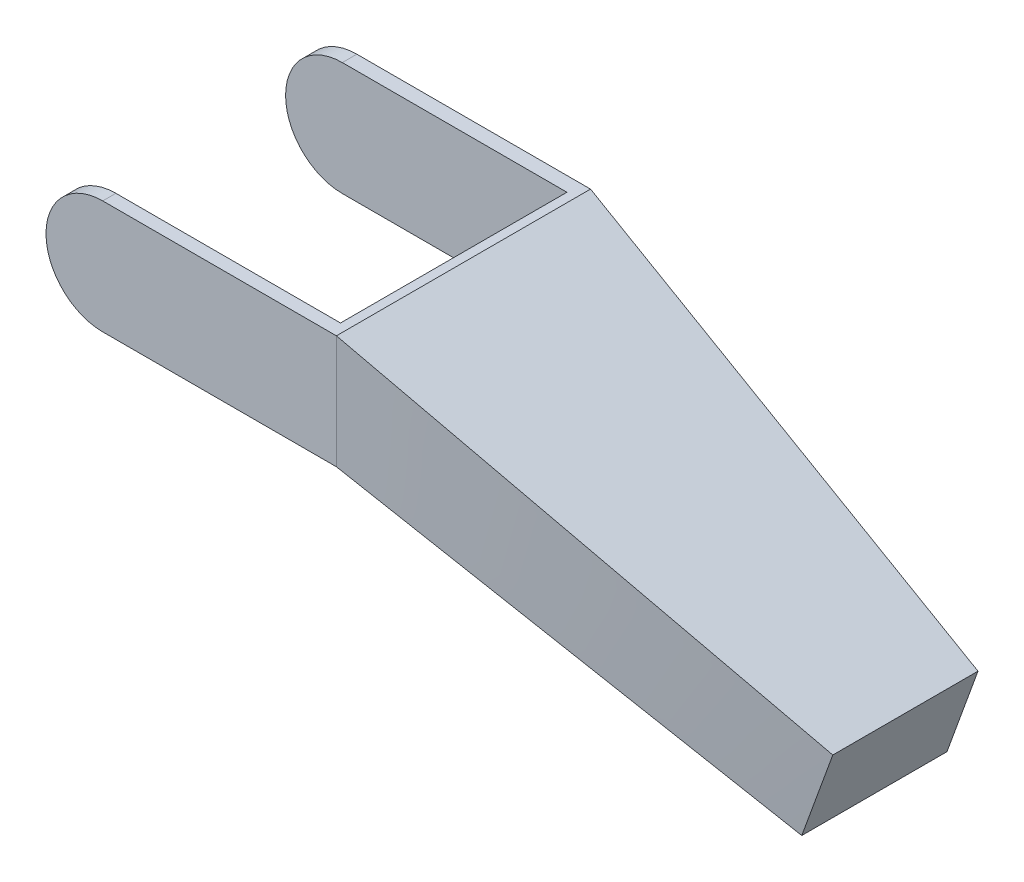
ISO-10303-21;
HEADER;
FILE_DESCRIPTION(('STEP AP214'),'2;1');
FILE_NAME('part.step','',(''),(''),'','','');
FILE_SCHEMA(('AUTOMOTIVE_DESIGN { 1 0 10303 214 1 1 1 1 }'));
ENDSEC;
DATA;
#1=APPLICATION_CONTEXT('core data for automotive mechanical design processes');
#2=APPLICATION_PROTOCOL_DEFINITION('international standard','automotive_design',2000,#1);
#3=PRODUCT_CONTEXT('',#1,'mechanical');
#4=PRODUCT('Part','Part','',(#3));
#5=PRODUCT_RELATED_PRODUCT_CATEGORY('part','',(#4));
#6=PRODUCT_DEFINITION_FORMATION('','',#4);
#7=PRODUCT_DEFINITION_CONTEXT('part definition',#1,'design');
#8=PRODUCT_DEFINITION('design','',#6,#7);
#9=PRODUCT_DEFINITION_SHAPE('','',#8);
#10=(LENGTH_UNIT() NAMED_UNIT(*) SI_UNIT(.MILLI.,.METRE.));
#11=(NAMED_UNIT(*) PLANE_ANGLE_UNIT() SI_UNIT($,.RADIAN.));
#12=(NAMED_UNIT(*) SI_UNIT($,.STERADIAN.) SOLID_ANGLE_UNIT());
#13=UNCERTAINTY_MEASURE_WITH_UNIT(LENGTH_MEASURE(1.E-05),#10,'distance_accuracy_value','');
#14=(GEOMETRIC_REPRESENTATION_CONTEXT(3) GLOBAL_UNCERTAINTY_ASSIGNED_CONTEXT((#13)) GLOBAL_UNIT_ASSIGNED_CONTEXT((#10,
#11,#12)) REPRESENTATION_CONTEXT('',''));
#15=CARTESIAN_POINT('',(0.,0.,0.));
#16=DIRECTION('',(0.,0.,1.));
#17=DIRECTION('',(1.,0.,0.));
#18=AXIS2_PLACEMENT_3D('',#15,#16,#17);
#19=CARTESIAN_POINT('',(0.,0.,28.));
#20=DIRECTION('',(0.,0.,-1.));
#21=DIRECTION('',(-1.,0.,0.));
#22=AXIS2_PLACEMENT_3D('',#19,#20,#21);
#23=CYLINDRICAL_SURFACE('',#22,12.5);
#24=CARTESIAN_POINT('',(0.,0.,-24.8));
#25=DIRECTION('',(0.,0.,1.));
#26=DIRECTION('',(1.,0.,0.));
#27=AXIS2_PLACEMENT_3D('',#24,#25,#26);
#28=CIRCLE('',#27,12.5);
#29=CARTESIAN_POINT('',(0.,12.5,-24.8));
#30=VERTEX_POINT('',#29);
#31=CARTESIAN_POINT('',(0.,-12.5,-24.8));
#32=VERTEX_POINT('',#31);
#33=EDGE_CURVE('E150',#30,#32,#28,.T.);
#34=ORIENTED_EDGE('',*,*,#33,.F.);
#35=DIRECTION('',(0.,0.,-1.));
#36=VECTOR('',#35,1.);
#37=CARTESIAN_POINT('',(0.,12.5,28.));
#38=LINE('',#37,#36);
#39=CARTESIAN_POINT('',(0.,12.5,-28.));
#40=VERTEX_POINT('',#39);
#41=EDGE_CURVE('E147',#30,#40,#38,.T.);
#42=ORIENTED_EDGE('',*,*,#41,.T.);
#43=CARTESIAN_POINT('',(0.,0.,-28.));
#44=DIRECTION('',(0.,0.,1.));
#45=DIRECTION('',(1.,0.,0.));
#46=AXIS2_PLACEMENT_3D('',#43,#44,#45);
#47=CIRCLE('',#46,12.5);
#48=CARTESIAN_POINT('',(0.,-12.5,-28.));
#49=VERTEX_POINT('',#48);
#50=EDGE_CURVE('E149',#40,#49,#47,.T.);
#51=ORIENTED_EDGE('',*,*,#50,.T.);
#52=DIRECTION('',(0.,0.,-1.));
#53=VECTOR('',#52,1.);
#54=CARTESIAN_POINT('',(0.,-12.5,28.));
#55=LINE('',#54,#53);
#56=EDGE_CURVE('E63',#32,#49,#55,.T.);
#57=ORIENTED_EDGE('',*,*,#56,.F.);
#58=EDGE_LOOP('',(#34,#42,#51,#57));
#59=FACE_BOUND('',#58,.T.);
#60=ADVANCED_FACE('F52',(#59),#23,.T.);
#61=CARTESIAN_POINT('',(0.,12.5,28.));
#62=VERTEX_POINT('',#61);
#63=CARTESIAN_POINT('',(0.,12.5,25.1));
#64=VERTEX_POINT('',#63);
#65=EDGE_CURVE('E153',#62,#64,#38,.T.);
#66=ORIENTED_EDGE('',*,*,#65,.T.);
#67=CARTESIAN_POINT('',(0.,0.,25.1));
#68=DIRECTION('',(0.,0.,1.));
#69=DIRECTION('',(1.,0.,0.));
#70=AXIS2_PLACEMENT_3D('',#67,#68,#69);
#71=CIRCLE('',#70,12.5);
#72=CARTESIAN_POINT('',(0.,-12.5,25.1));
#73=VERTEX_POINT('',#72);
#74=EDGE_CURVE('E320',#64,#73,#71,.T.);
#75=ORIENTED_EDGE('',*,*,#74,.T.);
#76=CARTESIAN_POINT('',(0.,-12.5,28.));
#77=VERTEX_POINT('',#76);
#78=EDGE_CURVE('E12',#77,#73,#55,.T.);
#79=ORIENTED_EDGE('',*,*,#78,.F.);
#80=CARTESIAN_POINT('',(0.,0.,28.));
#81=DIRECTION('',(0.,0.,1.));
#82=DIRECTION('',(1.,0.,0.));
#83=AXIS2_PLACEMENT_3D('',#80,#81,#82);
#84=CIRCLE('',#83,12.5);
#85=EDGE_CURVE('E160',#62,#77,#84,.T.);
#86=ORIENTED_EDGE('',*,*,#85,.F.);
#87=EDGE_LOOP('',(#66,#75,#79,#86));
#88=FACE_BOUND('',#87,.T.);
#89=ADVANCED_FACE('F54',(#88),#23,.T.);
#90=CARTESIAN_POINT('',(51.5,-12.5,28.));
#91=DIRECTION('',(0.,1.,0.));
#92=DIRECTION('',(-1.,0.,0.));
#93=AXIS2_PLACEMENT_3D('',#90,#91,#92);
#94=PLANE('',#93);
#95=ORIENTED_EDGE('',*,*,#78,.T.);
#96=DIRECTION('',(-1.,0.,0.));
#97=VECTOR('',#96,1.);
#98=CARTESIAN_POINT('',(49.5,-12.5,25.1));
#99=LINE('',#98,#97);
#100=CARTESIAN_POINT('',(49.5,-12.5,25.1));
#101=VERTEX_POINT('',#100);
#102=EDGE_CURVE('E317',#101,#73,#99,.T.);
#103=ORIENTED_EDGE('',*,*,#102,.F.);
#104=DIRECTION('',(0.,0.,-1.));
#105=VECTOR('',#104,1.);
#106=CARTESIAN_POINT('',(49.5,-12.5,25.1));
#107=LINE('',#106,#105);
#108=CARTESIAN_POINT('',(49.5,-12.5,-24.8));
#109=VERTEX_POINT('',#108);
#110=EDGE_CURVE('E165',#101,#109,#107,.T.);
#111=ORIENTED_EDGE('',*,*,#110,.T.);
#112=DIRECTION('',(-1.,0.,0.));
#113=VECTOR('',#112,1.);
#114=CARTESIAN_POINT('',(49.5,-12.5,-24.8));
#115=LINE('',#114,#113);
#116=EDGE_CURVE('E304',#109,#32,#115,.T.);
#117=ORIENTED_EDGE('',*,*,#116,.T.);
#118=ORIENTED_EDGE('',*,*,#56,.T.);
#119=DIRECTION('',(1.,0.,0.));
#120=VECTOR('',#119,1.);
#121=CARTESIAN_POINT('',(51.5,-12.5,-28.));
#122=LINE('',#121,#120);
#123=CARTESIAN_POINT('',(51.5,-12.5,-28.));
#124=VERTEX_POINT('',#123);
#125=EDGE_CURVE('E163',#49,#124,#122,.T.);
#126=ORIENTED_EDGE('',*,*,#125,.T.);
#127=DIRECTION('',(0.,0.,1.));
#128=VECTOR('',#127,1.);
#129=CARTESIAN_POINT('',(51.5,-12.5,0.));
#130=LINE('',#129,#128);
#131=CARTESIAN_POINT('',(51.5,-12.5,28.));
#132=VERTEX_POINT('',#131);
#133=EDGE_CURVE('E184',#132,#124,#130,.F.);
#134=ORIENTED_EDGE('',*,*,#133,.F.);
#135=DIRECTION('',(1.,0.,0.));
#136=VECTOR('',#135,1.);
#137=CARTESIAN_POINT('',(51.5,-12.5,28.));
#138=LINE('',#137,#136);
#139=EDGE_CURVE('E178',#77,#132,#138,.T.);
#140=ORIENTED_EDGE('',*,*,#139,.F.);
#141=EDGE_LOOP('',(#95,#103,#111,#117,#118,#126,#134,#140));
#142=FACE_BOUND('',#141,.T.);
#143=ADVANCED_FACE('F328',(#142),#94,.F.);
#144=CARTESIAN_POINT('',(0.,12.5,28.));
#145=DIRECTION('',(0.,-1.,0.));
#146=DIRECTION('',(1.,0.,0.));
#147=AXIS2_PLACEMENT_3D('',#144,#145,#146);
#148=PLANE('',#147);
#149=DIRECTION('',(0.,0.,-1.));
#150=VECTOR('',#149,1.);
#151=CARTESIAN_POINT('',(49.5,12.5,25.1));
#152=LINE('',#151,#150);
#153=CARTESIAN_POINT('',(49.5,12.5,25.1));
#154=VERTEX_POINT('',#153);
#155=CARTESIAN_POINT('',(49.5,12.5,-24.8));
#156=VERTEX_POINT('',#155);
#157=EDGE_CURVE('E171',#154,#156,#152,.T.);
#158=ORIENTED_EDGE('',*,*,#157,.F.);
#159=DIRECTION('',(1.,0.,0.));
#160=VECTOR('',#159,1.);
#161=CARTESIAN_POINT('',(0.,12.5,25.1));
#162=LINE('',#161,#160);
#163=EDGE_CURVE('E309',#64,#154,#162,.T.);
#164=ORIENTED_EDGE('',*,*,#163,.F.);
#165=ORIENTED_EDGE('',*,*,#65,.F.);
#166=DIRECTION('',(-1.,0.,0.));
#167=VECTOR('',#166,1.);
#168=CARTESIAN_POINT('',(0.,12.5,28.));
#169=LINE('',#168,#167);
#170=CARTESIAN_POINT('',(51.5,12.5,28.));
#171=VERTEX_POINT('',#170);
#172=EDGE_CURVE('E154',#171,#62,#169,.T.);
#173=ORIENTED_EDGE('',*,*,#172,.F.);
#174=DIRECTION('',(0.,0.,1.));
#175=VECTOR('',#174,1.);
#176=CARTESIAN_POINT('',(51.5,12.5,28.));
#177=LINE('',#176,#175);
#178=CARTESIAN_POINT('',(51.5,12.5,-28.));
#179=VERTEX_POINT('',#178);
#180=EDGE_CURVE('E141',#171,#179,#177,.F.);
#181=ORIENTED_EDGE('',*,*,#180,.T.);
#182=DIRECTION('',(-1.,0.,0.));
#183=VECTOR('',#182,1.);
#184=CARTESIAN_POINT('',(0.,12.5,-28.));
#185=LINE('',#184,#183);
#186=EDGE_CURVE('E156',#179,#40,#185,.T.);
#187=ORIENTED_EDGE('',*,*,#186,.T.);
#188=ORIENTED_EDGE('',*,*,#41,.F.);
#189=DIRECTION('',(1.,0.,0.));
#190=VECTOR('',#189,1.);
#191=CARTESIAN_POINT('',(0.,12.5,-24.8));
#192=LINE('',#191,#190);
#193=EDGE_CURVE('E270',#30,#156,#192,.T.);
#194=ORIENTED_EDGE('',*,*,#193,.T.);
#195=EDGE_LOOP('',(#158,#164,#165,#173,#181,#187,#188,#194));
#196=FACE_BOUND('',#195,.T.);
#197=ADVANCED_FACE('F158',(#196),#148,.F.);
#198=CARTESIAN_POINT('',(0.,0.,28.));
#199=DIRECTION('',(0.,0.,1.));
#200=DIRECTION('',(1.,0.,0.));
#201=AXIS2_PLACEMENT_3D('',#198,#199,#200);
#202=PLANE('',#201);
#203=ORIENTED_EDGE('',*,*,#85,.T.);
#204=ORIENTED_EDGE('',*,*,#139,.T.);
#205=DIRECTION('',(0.,1.,0.));
#206=VECTOR('',#205,1.);
#207=CARTESIAN_POINT('',(51.5,0.,28.));
#208=LINE('',#207,#206);
#209=EDGE_CURVE('E181',#132,#171,#208,.T.);
#210=ORIENTED_EDGE('',*,*,#209,.T.);
#211=ORIENTED_EDGE('',*,*,#172,.T.);
#212=EDGE_LOOP('',(#203,#204,#210,#211));
#213=FACE_BOUND('',#212,.T.);
#214=ADVANCED_FACE('F337',(#213),#202,.T.);
#215=CARTESIAN_POINT('',(0.,0.,-28.));
#216=DIRECTION('',(0.,0.,1.));
#217=DIRECTION('',(1.,0.,0.));
#218=AXIS2_PLACEMENT_3D('',#215,#216,#217);
#219=PLANE('',#218);
#220=ORIENTED_EDGE('',*,*,#50,.F.);
#221=ORIENTED_EDGE('',*,*,#186,.F.);
#222=DIRECTION('',(0.,1.,0.));
#223=VECTOR('',#222,1.);
#224=CARTESIAN_POINT('',(51.5,0.,-28.));
#225=LINE('',#224,#223);
#226=EDGE_CURVE('E56',#124,#179,#225,.T.);
#227=ORIENTED_EDGE('',*,*,#226,.F.);
#228=ORIENTED_EDGE('',*,*,#125,.F.);
#229=EDGE_LOOP('',(#220,#221,#227,#228));
#230=FACE_BOUND('',#229,.T.);
#231=ADVANCED_FACE('F162',(#230),#219,.F.);
#232=CARTESIAN_POINT('',(49.5,12.5,25.1));
#233=DIRECTION('',(1.,0.,0.));
#234=DIRECTION('',(0.,0.,-1.));
#235=AXIS2_PLACEMENT_3D('',#232,#233,#234);
#236=PLANE('',#235);
#237=ORIENTED_EDGE('',*,*,#110,.F.);
#238=DIRECTION('',(0.,-1.,0.));
#239=VECTOR('',#238,1.);
#240=CARTESIAN_POINT('',(49.5,12.5,25.1));
#241=LINE('',#240,#239);
#242=EDGE_CURVE('E313',#154,#101,#241,.T.);
#243=ORIENTED_EDGE('',*,*,#242,.F.);
#244=ORIENTED_EDGE('',*,*,#157,.T.);
#245=DIRECTION('',(0.,-1.,0.));
#246=VECTOR('',#245,1.);
#247=CARTESIAN_POINT('',(49.5,12.5,-24.8));
#248=LINE('',#247,#246);
#249=EDGE_CURVE('E72',#156,#109,#248,.T.);
#250=ORIENTED_EDGE('',*,*,#249,.T.);
#251=EDGE_LOOP('',(#237,#243,#244,#250));
#252=FACE_BOUND('',#251,.T.);
#253=ADVANCED_FACE('F325',(#252),#236,.F.);
#254=CARTESIAN_POINT('',(0.,0.,25.1));
#255=DIRECTION('',(0.,0.,1.));
#256=DIRECTION('',(1.,0.,0.));
#257=AXIS2_PLACEMENT_3D('',#254,#255,#256);
#258=PLANE('',#257);
#259=ORIENTED_EDGE('',*,*,#163,.T.);
#260=ORIENTED_EDGE('',*,*,#242,.T.);
#261=ORIENTED_EDGE('',*,*,#102,.T.);
#262=ORIENTED_EDGE('',*,*,#74,.F.);
#263=EDGE_LOOP('',(#259,#260,#261,#262));
#264=FACE_BOUND('',#263,.T.);
#265=ADVANCED_FACE('F331',(#264),#258,.F.);
#266=CARTESIAN_POINT('',(0.,0.,-24.8));
#267=DIRECTION('',(0.,0.,1.));
#268=DIRECTION('',(1.,0.,0.));
#269=AXIS2_PLACEMENT_3D('',#266,#267,#268);
#270=PLANE('',#269);
#271=ORIENTED_EDGE('',*,*,#193,.F.);
#272=ORIENTED_EDGE('',*,*,#33,.T.);
#273=ORIENTED_EDGE('',*,*,#116,.F.);
#274=ORIENTED_EDGE('',*,*,#249,.F.);
#275=EDGE_LOOP('',(#271,#272,#273,#274));
#276=FACE_BOUND('',#275,.T.);
#277=ADVANCED_FACE('F327',(#276),#270,.T.);
#278=CARTESIAN_POINT('',(139.444906488905,-50.7537952819954,0.));
#279=DIRECTION('',(0.939692620785908,-0.342020143325669,0.));
#280=DIRECTION('',(0.342020143325669,0.939692620785908,0.));
#281=AXIS2_PLACEMENT_3D('',#278,#279,#280);
#282=PLANE('',#281);
#283=DIRECTION('',(0.342020143325669,0.939692620785908,0.));
#284=VECTOR('',#283,1.);
#285=CARTESIAN_POINT('',(148.889463511848,-24.8050881247079,-16.));
#286=LINE('',#285,#284);
#287=CARTESIAN_POINT('',(142.049060645334,-43.598940540426,-16.));
#288=VERTEX_POINT('',#287);
#289=CARTESIAN_POINT('',(148.889463511848,-24.8050881247079,-16.));
#290=VERTEX_POINT('',#289);
#291=EDGE_CURVE('E211',#288,#290,#286,.T.);
#292=ORIENTED_EDGE('',*,*,#291,.T.);
#293=DIRECTION('',(0.,0.,1.));
#294=VECTOR('',#293,1.);
#295=CARTESIAN_POINT('',(148.889463511848,-24.8050881247079,16.));
#296=LINE('',#295,#294);
#297=CARTESIAN_POINT('',(148.889463511848,-24.8050881247079,16.));
#298=VERTEX_POINT('',#297);
#299=EDGE_CURVE('E207',#290,#298,#296,.T.);
#300=ORIENTED_EDGE('',*,*,#299,.T.);
#301=DIRECTION('',(-0.342020143325669,-0.939692620785908,0.));
#302=VECTOR('',#301,1.);
#303=CARTESIAN_POINT('',(148.889463511848,-24.8050881247079,16.));
#304=LINE('',#303,#302);
#305=CARTESIAN_POINT('',(142.049060645334,-43.598940540426,16.));
#306=VERTEX_POINT('',#305);
#307=EDGE_CURVE('E101',#298,#306,#304,.T.);
#308=ORIENTED_EDGE('',*,*,#307,.T.);
#309=DIRECTION('',(0.,0.,-1.));
#310=VECTOR('',#309,1.);
#311=CARTESIAN_POINT('',(142.049060645334,-43.598940540426,16.));
#312=LINE('',#311,#310);
#313=EDGE_CURVE('E215',#306,#288,#312,.T.);
#314=ORIENTED_EDGE('',*,*,#313,.T.);
#315=EDGE_LOOP('',(#292,#300,#308,#314));
#316=FACE_BOUND('',#315,.T.);
#317=ADVANCED_FACE('F246',(#316),#282,.T.);
#318=CARTESIAN_POINT('',(51.5,12.5,28.));
#319=CARTESIAN_POINT('',(148.889463511848,-24.8050881247079,16.));
#320=CARTESIAN_POINT('',(51.5,8.33333333333333,28.));
#321=CARTESIAN_POINT('',(147.749396367429,-27.9373968606609,16.));
#322=CARTESIAN_POINT('',(51.5,4.16666666666667,28.));
#323=CARTESIAN_POINT('',(146.60932922301,-31.0697055966139,16.));
#324=CARTESIAN_POINT('',(51.5,-4.16666666666666,28.));
#325=CARTESIAN_POINT('',(144.329194934172,-37.33432306852,16.));
#326=CARTESIAN_POINT('',(51.5,-8.33333333333333,28.));
#327=CARTESIAN_POINT('',(143.189127789753,-40.466631804473,16.));
#328=CARTESIAN_POINT('',(51.5,-12.5,28.));
#329=CARTESIAN_POINT('',(142.049060645334,-43.598940540426,16.));
#330=B_SPLINE_SURFACE_WITH_KNOTS('',3,1,((#318,#319),(#320,#321),(#322,#323),(#324,#325),(#326,
#327),(#328,#329)),.UNSPECIFIED.,.F.,.F.,.F.,(4,2,4),(2,2),(0.,0.5,1.),(0.,1.),.UNSPECIFIED.);
#331=DIRECTION('',(0.938431679254752,-0.322302967986665,-0.12436551048459));
#332=VECTOR('',#331,1.);
#333=CARTESIAN_POINT('',(96.7745303226671,-28.049470270213,22.));
#334=LINE('',#333,#332);
#335=EDGE_CURVE('E217',#132,#306,#334,.T.);
#336=DIRECTION('',(-0.927713216186065,0.355361063058604,0.11430968189776));
#337=VECTOR('',#336,1.);
#338=CARTESIAN_POINT('',(100.194731755924,-6.15254406235393,22.));
#339=LINE('',#338,#337);
#340=EDGE_CURVE('E344',#298,#171,#339,.T.);
#341=ORIENTED_EDGE('',*,*,#209,.F.);
#342=ORIENTED_EDGE('',*,*,#335,.T.);
#343=ORIENTED_EDGE('',*,*,#307,.F.);
#344=ORIENTED_EDGE('',*,*,#340,.T.);
#345=EDGE_LOOP('',(#341,#342,#343,#344));
#346=FACE_BOUND('',#345,.T.);
#347=ADVANCED_FACE('F342',(#346),#330,.T.);
#348=CARTESIAN_POINT('',(1.59368672219045,4.64024925446255,0.));
#349=DIRECTION('',(0.324824753493267,0.945774222274026,0.));
#350=DIRECTION('',(-0.945774222274026,0.324824753493267,0.));
#351=AXIS2_PLACEMENT_3D('',#348,#349,#350);
#352=PLANE('',#351);
#353=DIRECTION('',(0.938431679254752,-0.322302967986665,0.124365510484589));
#354=VECTOR('',#353,1.);
#355=CARTESIAN_POINT('',(51.5,-12.5,-28.));
#356=LINE('',#355,#354);
#357=EDGE_CURVE('E202',#124,#288,#356,.T.);
#358=ORIENTED_EDGE('',*,*,#357,.T.);
#359=ORIENTED_EDGE('',*,*,#313,.F.);
#360=ORIENTED_EDGE('',*,*,#335,.F.);
#361=ORIENTED_EDGE('',*,*,#133,.T.);
#362=EDGE_LOOP('',(#358,#359,#360,#361));
#363=FACE_BOUND('',#362,.T.);
#364=ADVANCED_FACE('F238',(#363),#352,.F.);
#365=CARTESIAN_POINT('',(10.7650749598985,28.1035356760076,0.));
#366=DIRECTION('',(-0.357705765190693,-0.933834345882256,0.));
#367=DIRECTION('',(0.933834345882256,-0.357705765190693,0.));
#368=AXIS2_PLACEMENT_3D('',#365,#366,#367);
#369=PLANE('',#368);
#370=ORIENTED_EDGE('',*,*,#340,.F.);
#371=ORIENTED_EDGE('',*,*,#299,.F.);
#372=DIRECTION('',(0.927713216186065,-0.355361063058604,0.11430968189776));
#373=VECTOR('',#372,1.);
#374=CARTESIAN_POINT('',(100.194731755924,-6.15254406235393,-22.));
#375=LINE('',#374,#373);
#376=EDGE_CURVE('E199',#179,#290,#375,.T.);
#377=ORIENTED_EDGE('',*,*,#376,.F.);
#378=ORIENTED_EDGE('',*,*,#180,.F.);
#379=EDGE_LOOP('',(#370,#371,#377,#378));
#380=FACE_BOUND('',#379,.T.);
#381=ADVANCED_FACE('F205',(#380),#369,.F.);
#382=CARTESIAN_POINT('',(51.5,-12.5,-28.));
#383=CARTESIAN_POINT('',(142.049060645334,-43.598940540426,-16.));
#384=CARTESIAN_POINT('',(51.5,-8.33333333333333,-28.));
#385=CARTESIAN_POINT('',(143.189127789753,-40.466631804473,-16.));
#386=CARTESIAN_POINT('',(51.5,-4.16666666666667,-28.));
#387=CARTESIAN_POINT('',(144.329194934172,-37.33432306852,-16.));
#388=CARTESIAN_POINT('',(51.5,4.16666666666666,-28.));
#389=CARTESIAN_POINT('',(146.60932922301,-31.0697055966139,-16.));
#390=CARTESIAN_POINT('',(51.5,8.33333333333333,-28.));
#391=CARTESIAN_POINT('',(147.749396367429,-27.9373968606609,-16.));
#392=CARTESIAN_POINT('',(51.5,12.5,-28.));
#393=CARTESIAN_POINT('',(148.889463511848,-24.8050881247079,-16.));
#394=B_SPLINE_SURFACE_WITH_KNOTS('',3,1,((#382,#383),(#384,#385),(#386,#387),(#388,#389),(#390,
#391),(#392,#393)),.UNSPECIFIED.,.F.,.F.,.F.,(4,2,4),(2,2),(0.,0.5,1.),(0.,1.),.UNSPECIFIED.);
#395=ORIENTED_EDGE('',*,*,#226,.T.);
#396=ORIENTED_EDGE('',*,*,#376,.T.);
#397=ORIENTED_EDGE('',*,*,#291,.F.);
#398=ORIENTED_EDGE('',*,*,#357,.F.);
#399=EDGE_LOOP('',(#395,#396,#397,#398));
#400=FACE_BOUND('',#399,.T.);
#401=ADVANCED_FACE('F197',(#400),#394,.T.);
#402=CLOSED_SHELL('',(#60,#89,#143,#197,#214,#231,#253,#265,#277,#317,#347,#364,#381,#401));
#403=MANIFOLD_SOLID_BREP('B2',#402);
#404=ADVANCED_BREP_SHAPE_REPRESENTATION('',(#18,#403),#14);
#405=SHAPE_DEFINITION_REPRESENTATION(#9,#404);
ENDSEC;
END-ISO-10303-21;
